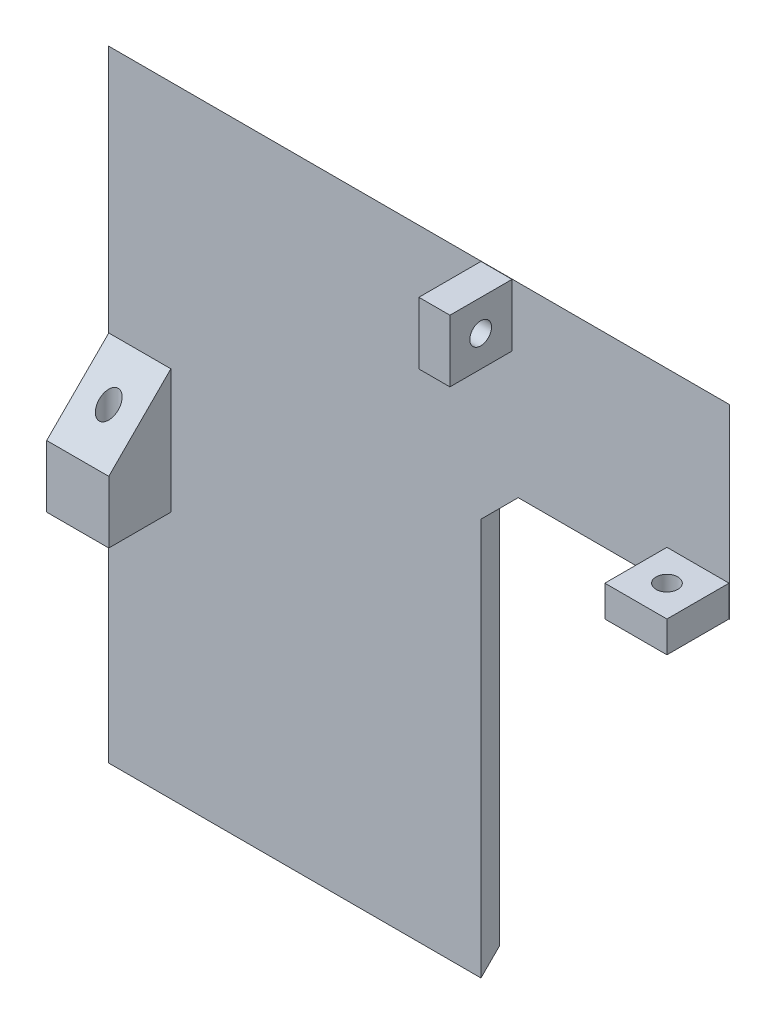
ISO-10303-21;
HEADER;
FILE_DESCRIPTION(('STEP AP214'),'2;1');
FILE_NAME('part.step','',(''),(''),'','','');
FILE_SCHEMA(('AUTOMOTIVE_DESIGN { 1 0 10303 214 1 1 1 1 }'));
ENDSEC;
DATA;
#1=APPLICATION_CONTEXT('core data for automotive mechanical design processes');
#2=APPLICATION_PROTOCOL_DEFINITION('international standard','automotive_design',2000,#1);
#3=PRODUCT_CONTEXT('',#1,'mechanical');
#4=PRODUCT('Part','Part','',(#3));
#5=PRODUCT_RELATED_PRODUCT_CATEGORY('part','',(#4));
#6=PRODUCT_DEFINITION_FORMATION('','',#4);
#7=PRODUCT_DEFINITION_CONTEXT('part definition',#1,'design');
#8=PRODUCT_DEFINITION('design','',#6,#7);
#9=PRODUCT_DEFINITION_SHAPE('','',#8);
#10=(LENGTH_UNIT() NAMED_UNIT(*) SI_UNIT(.MILLI.,.METRE.));
#11=(NAMED_UNIT(*) PLANE_ANGLE_UNIT() SI_UNIT($,.RADIAN.));
#12=(NAMED_UNIT(*) SI_UNIT($,.STERADIAN.) SOLID_ANGLE_UNIT());
#13=UNCERTAINTY_MEASURE_WITH_UNIT(LENGTH_MEASURE(1.E-05),#10,'distance_accuracy_value','');
#14=(GEOMETRIC_REPRESENTATION_CONTEXT(3) GLOBAL_UNCERTAINTY_ASSIGNED_CONTEXT((#13)) GLOBAL_UNIT_ASSIGNED_CONTEXT((#10,
#11,#12)) REPRESENTATION_CONTEXT('',''));
#15=CARTESIAN_POINT('',(0.,0.,0.));
#16=DIRECTION('',(0.,0.,1.));
#17=DIRECTION('',(1.,0.,0.));
#18=AXIS2_PLACEMENT_3D('',#15,#16,#17);
#19=CARTESIAN_POINT('',(0.,0.,3.));
#20=DIRECTION('',(0.,0.,1.));
#21=DIRECTION('',(1.,0.,0.));
#22=AXIS2_PLACEMENT_3D('',#19,#20,#21);
#23=PLANE('',#22);
#24=DIRECTION('',(-1.,0.,0.));
#25=VECTOR('',#24,1.);
#26=CARTESIAN_POINT('',(65.,99.95,3.));
#27=LINE('',#26,#25);
#28=CARTESIAN_POINT('',(65.,99.95,3.));
#29=VERTEX_POINT('',#28);
#30=CARTESIAN_POINT('',(60.,99.95,3.));
#31=VERTEX_POINT('',#30);
#32=EDGE_CURVE('E273',#29,#31,#27,.T.);
#33=ORIENTED_EDGE('',*,*,#32,.F.);
#34=DIRECTION('',(0.,1.,0.));
#35=VECTOR('',#34,1.);
#36=CARTESIAN_POINT('',(65.,99.95,3.));
#37=LINE('',#36,#35);
#38=CARTESIAN_POINT('',(65.,89.95,3.));
#39=VERTEX_POINT('',#38);
#40=EDGE_CURVE('E220',#39,#29,#37,.T.);
#41=ORIENTED_EDGE('',*,*,#40,.F.);
#42=DIRECTION('',(1.,0.,0.));
#43=VECTOR('',#42,1.);
#44=CARTESIAN_POINT('',(65.,89.95,3.));
#45=LINE('',#44,#43);
#46=CARTESIAN_POINT('',(60.,89.95,3.));
#47=VERTEX_POINT('',#46);
#48=EDGE_CURVE('E277',#47,#39,#45,.T.);
#49=ORIENTED_EDGE('',*,*,#48,.F.);
#50=DIRECTION('',(0.,-1.,0.));
#51=VECTOR('',#50,1.);
#52=CARTESIAN_POINT('',(60.,99.95,3.));
#53=LINE('',#52,#51);
#54=EDGE_CURVE('E208',#31,#47,#53,.T.);
#55=ORIENTED_EDGE('',*,*,#54,.F.);
#56=EDGE_LOOP('',(#33,#41,#49,#55));
#57=FACE_BOUND('',#56,.T.);
#58=DIRECTION('',(1.,0.,0.));
#59=VECTOR('',#58,1.);
#60=CARTESIAN_POINT('',(0.0499999999999819,40.,3.));
#61=LINE('',#60,#59);
#62=CARTESIAN_POINT('',(0.0499999999999819,40.,3.));
#63=VERTEX_POINT('',#62);
#64=CARTESIAN_POINT('',(10.05,40.,3.));
#65=VERTEX_POINT('',#64);
#66=EDGE_CURVE('E256',#63,#65,#61,.T.);
#67=ORIENTED_EDGE('',*,*,#66,.F.);
#68=DIRECTION('',(0.,-1.,0.));
#69=VECTOR('',#68,1.);
#70=CARTESIAN_POINT('',(0.0499999999999793,60.,3.));
#71=LINE('',#70,#69);
#72=CARTESIAN_POINT('',(0.0499999999999793,60.,3.));
#73=VERTEX_POINT('',#72);
#74=EDGE_CURVE('E241',#73,#63,#71,.T.);
#75=ORIENTED_EDGE('',*,*,#74,.F.);
#76=DIRECTION('',(-1.,0.,0.));
#77=VECTOR('',#76,1.);
#78=CARTESIAN_POINT('',(0.0499999999999793,60.,3.));
#79=LINE('',#78,#77);
#80=CARTESIAN_POINT('',(10.05,60.,3.));
#81=VERTEX_POINT('',#80);
#82=EDGE_CURVE('E235',#81,#73,#79,.T.);
#83=ORIENTED_EDGE('',*,*,#82,.F.);
#84=DIRECTION('',(0.,1.,0.));
#85=VECTOR('',#84,1.);
#86=CARTESIAN_POINT('',(10.05,60.,3.));
#87=LINE('',#86,#85);
#88=EDGE_CURVE('E239',#65,#81,#87,.T.);
#89=ORIENTED_EDGE('',*,*,#88,.F.);
#90=EDGE_LOOP('',(#67,#75,#83,#89));
#91=FACE_BOUND('',#90,.T.);
#92=DIRECTION('',(0.,-1.,0.));
#93=VECTOR('',#92,1.);
#94=CARTESIAN_POINT('',(60.,-6.39993401119926,3.));
#95=LINE('',#94,#93);
#96=CARTESIAN_POINT('',(60.,64.,3.));
#97=VERTEX_POINT('',#96);
#98=CARTESIAN_POINT('',(60.,0.,3.));
#99=VERTEX_POINT('',#98);
#100=EDGE_CURVE('E204',#97,#99,#95,.T.);
#101=ORIENTED_EDGE('',*,*,#100,.F.);
#102=DIRECTION('',(-0.707106781186541,-0.707106781186554,0.));
#103=VECTOR('',#102,1.);
#104=CARTESIAN_POINT('',(60.,64.,3.));
#105=LINE('',#104,#103);
#106=CARTESIAN_POINT('',(65.9999999999999,70.,3.));
#107=VERTEX_POINT('',#106);
#108=EDGE_CURVE('E43',#97,#107,#105,.F.);
#109=ORIENTED_EDGE('',*,*,#108,.T.);
#110=DIRECTION('',(-1.,0.,0.));
#111=VECTOR('',#110,1.);
#112=CARTESIAN_POINT('',(115.202992823612,70.,3.));
#113=LINE('',#112,#111);
#114=CARTESIAN_POINT('',(100.,70.,3.));
#115=VERTEX_POINT('',#114);
#116=EDGE_CURVE('E200',#115,#107,#113,.T.);
#117=ORIENTED_EDGE('',*,*,#116,.F.);
#118=DIRECTION('',(0.,1.,0.));
#119=VECTOR('',#118,1.);
#120=CARTESIAN_POINT('',(100.,100.,3.));
#121=LINE('',#120,#119);
#122=CARTESIAN_POINT('',(100.,100.,3.));
#123=VERTEX_POINT('',#122);
#124=EDGE_CURVE('E190',#115,#123,#121,.T.);
#125=ORIENTED_EDGE('',*,*,#124,.T.);
#126=DIRECTION('',(-1.,0.,0.));
#127=VECTOR('',#126,1.);
#128=CARTESIAN_POINT('',(0.,100.,3.));
#129=LINE('',#128,#127);
#130=CARTESIAN_POINT('',(0.,100.,3.));
#131=VERTEX_POINT('',#130);
#132=EDGE_CURVE('E192',#123,#131,#129,.T.);
#133=ORIENTED_EDGE('',*,*,#132,.T.);
#134=DIRECTION('',(0.,-1.,0.));
#135=VECTOR('',#134,1.);
#136=CARTESIAN_POINT('',(0.,100.,3.));
#137=LINE('',#136,#135);
#138=CARTESIAN_POINT('',(0.,0.,3.));
#139=VERTEX_POINT('',#138);
#140=EDGE_CURVE('E247',#131,#139,#137,.T.);
#141=ORIENTED_EDGE('',*,*,#140,.T.);
#142=DIRECTION('',(1.,0.,0.));
#143=VECTOR('',#142,1.);
#144=CARTESIAN_POINT('',(0.,0.,3.));
#145=LINE('',#144,#143);
#146=EDGE_CURVE('E249',#139,#99,#145,.T.);
#147=ORIENTED_EDGE('',*,*,#146,.T.);
#148=EDGE_LOOP('',(#101,#109,#117,#125,#133,#141,#147));
#149=FACE_BOUND('',#148,.T.);
#150=DIRECTION('',(1.,0.,0.));
#151=VECTOR('',#150,1.);
#152=CARTESIAN_POINT('',(89.95,70.05,3.));
#153=LINE('',#152,#151);
#154=CARTESIAN_POINT('',(89.95,70.05,3.));
#155=VERTEX_POINT('',#154);
#156=CARTESIAN_POINT('',(99.95,70.05,3.));
#157=VERTEX_POINT('',#156);
#158=EDGE_CURVE('E611',#155,#157,#153,.T.);
#159=ORIENTED_EDGE('',*,*,#158,.F.);
#160=DIRECTION('',(0.,-1.,0.));
#161=VECTOR('',#160,1.);
#162=CARTESIAN_POINT('',(89.95,75.05,3.));
#163=LINE('',#162,#161);
#164=CARTESIAN_POINT('',(89.95,75.05,3.));
#165=VERTEX_POINT('',#164);
#166=EDGE_CURVE('E188',#165,#155,#163,.T.);
#167=ORIENTED_EDGE('',*,*,#166,.F.);
#168=DIRECTION('',(-1.,0.,0.));
#169=VECTOR('',#168,1.);
#170=CARTESIAN_POINT('',(89.95,75.05,3.));
#171=LINE('',#170,#169);
#172=CARTESIAN_POINT('',(99.95,75.05,3.));
#173=VERTEX_POINT('',#172);
#174=EDGE_CURVE('E184',#173,#165,#171,.T.);
#175=ORIENTED_EDGE('',*,*,#174,.F.);
#176=DIRECTION('',(0.,1.,0.));
#177=VECTOR('',#176,1.);
#178=CARTESIAN_POINT('',(99.95,75.05,3.));
#179=LINE('',#178,#177);
#180=EDGE_CURVE('E618',#157,#173,#179,.T.);
#181=ORIENTED_EDGE('',*,*,#180,.F.);
#182=EDGE_LOOP('',(#159,#167,#175,#181));
#183=FACE_BOUND('',#182,.T.);
#184=ADVANCED_FACE('F35',(#57,#91,#149,#183),#23,.T.);
#185=CARTESIAN_POINT('',(0.,0.,0.));
#186=DIRECTION('',(0.,0.,1.));
#187=DIRECTION('',(1.,0.,0.));
#188=AXIS2_PLACEMENT_3D('',#185,#186,#187);
#189=PLANE('',#188);
#190=DIRECTION('',(-1.,0.,0.));
#191=VECTOR('',#190,1.);
#192=CARTESIAN_POINT('',(0.,70.,0.));
#193=LINE('',#192,#191);
#194=CARTESIAN_POINT('',(97.,70.,0.));
#195=VERTEX_POINT('',#194);
#196=CARTESIAN_POINT('',(65.9999999999999,70.,0.));
#197=VERTEX_POINT('',#196);
#198=EDGE_CURVE('E252',#195,#197,#193,.T.);
#199=ORIENTED_EDGE('',*,*,#198,.T.);
#200=DIRECTION('',(0.707106781186541,0.707106781186554,0.));
#201=VECTOR('',#200,1.);
#202=CARTESIAN_POINT('',(-1.99999999999946,1.99999999999943,0.));
#203=LINE('',#202,#201);
#204=CARTESIAN_POINT('',(60.,64.,0.));
#205=VERTEX_POINT('',#204);
#206=EDGE_CURVE('E11',#197,#205,#203,.F.);
#207=ORIENTED_EDGE('',*,*,#206,.T.);
#208=DIRECTION('',(0.,-1.,0.));
#209=VECTOR('',#208,1.);
#210=CARTESIAN_POINT('',(60.,0.,0.));
#211=LINE('',#210,#209);
#212=CARTESIAN_POINT('',(60.,3.00000000000002,0.));
#213=VERTEX_POINT('',#212);
#214=EDGE_CURVE('E224',#205,#213,#211,.T.);
#215=ORIENTED_EDGE('',*,*,#214,.T.);
#216=DIRECTION('',(-1.,0.,0.));
#217=VECTOR('',#216,1.);
#218=CARTESIAN_POINT('',(0.,3.00000000000002,0.));
#219=LINE('',#218,#217);
#220=CARTESIAN_POINT('',(3.00000000000002,3.00000000000002,0.));
#221=VERTEX_POINT('',#220);
#222=EDGE_CURVE('E221',#213,#221,#219,.T.);
#223=ORIENTED_EDGE('',*,*,#222,.T.);
#224=DIRECTION('',(0.,1.,0.));
#225=VECTOR('',#224,1.);
#226=CARTESIAN_POINT('',(3.00000000000002,0.,0.));
#227=LINE('',#226,#225);
#228=CARTESIAN_POINT('',(3.,97.,0.));
#229=VERTEX_POINT('',#228);
#230=EDGE_CURVE('E223',#221,#229,#227,.T.);
#231=ORIENTED_EDGE('',*,*,#230,.T.);
#232=DIRECTION('',(1.,0.,0.));
#233=VECTOR('',#232,1.);
#234=CARTESIAN_POINT('',(0.,97.,0.));
#235=LINE('',#234,#233);
#236=CARTESIAN_POINT('',(97.,97.,0.));
#237=VERTEX_POINT('',#236);
#238=EDGE_CURVE('E229',#229,#237,#235,.T.);
#239=ORIENTED_EDGE('',*,*,#238,.T.);
#240=DIRECTION('',(0.,-1.,0.));
#241=VECTOR('',#240,1.);
#242=CARTESIAN_POINT('',(97.,0.,0.));
#243=LINE('',#242,#241);
#244=EDGE_CURVE('E225',#237,#195,#243,.T.);
#245=ORIENTED_EDGE('',*,*,#244,.T.);
#246=EDGE_LOOP('',(#199,#207,#215,#223,#231,#239,#245));
#247=FACE_BOUND('',#246,.T.);
#248=ADVANCED_FACE('F328',(#247),#189,.F.);
#249=CARTESIAN_POINT('',(0.0499999999999793,60.,13.));
#250=DIRECTION('',(1.,0.,0.));
#251=DIRECTION('',(0.,1.,0.));
#252=AXIS2_PLACEMENT_3D('',#249,#250,#251);
#253=PLANE('',#252);
#254=DIRECTION('',(0.,-1.,0.));
#255=VECTOR('',#254,1.);
#256=CARTESIAN_POINT('',(0.0499999999999793,60.,13.));
#257=LINE('',#256,#255);
#258=CARTESIAN_POINT('',(0.0499999999999806,50.,13.));
#259=VERTEX_POINT('',#258);
#260=CARTESIAN_POINT('',(0.0499999999999819,40.,13.));
#261=VERTEX_POINT('',#260);
#262=EDGE_CURVE('E245',#259,#261,#257,.T.);
#263=ORIENTED_EDGE('',*,*,#262,.F.);
#264=DIRECTION('',(0.,0.707106781186547,-0.707106781186549));
#265=VECTOR('',#264,1.);
#266=CARTESIAN_POINT('',(0.0499999999999806,50.,13.));
#267=LINE('',#266,#265);
#268=EDGE_CURVE('E228',#259,#73,#267,.T.);
#269=ORIENTED_EDGE('',*,*,#268,.T.);
#270=ORIENTED_EDGE('',*,*,#74,.T.);
#271=DIRECTION('',(0.,0.,-1.));
#272=VECTOR('',#271,1.);
#273=CARTESIAN_POINT('',(0.0499999999999819,40.,13.));
#274=LINE('',#273,#272);
#275=EDGE_CURVE('E254',#261,#63,#274,.T.);
#276=ORIENTED_EDGE('',*,*,#275,.F.);
#277=EDGE_LOOP('',(#263,#269,#270,#276));
#278=FACE_BOUND('',#277,.T.);
#279=ADVANCED_FACE('F344',(#278),#253,.F.);
#280=CARTESIAN_POINT('',(0.0499999999999819,40.,13.));
#281=DIRECTION('',(0.,1.,0.));
#282=DIRECTION('',(0.,0.,1.));
#283=AXIS2_PLACEMENT_3D('',#280,#281,#282);
#284=PLANE('',#283);
#285=CARTESIAN_POINT('',(5.04622786455411,40.,8.));
#286=DIRECTION('',(0.,-1.,0.));
#287=DIRECTION('',(0.,0.,-1.));
#288=AXIS2_PLACEMENT_3D('',#285,#286,#287);
#289=CIRCLE('',#288,1.525);
#290=CARTESIAN_POINT('',(5.04622786455411,40.,6.475));
#291=VERTEX_POINT('',#290);
#292=EDGE_CURVE('E214',#291,#291,#289,.T.);
#293=ORIENTED_EDGE('',*,*,#292,.F.);
#294=EDGE_LOOP('',(#293));
#295=FACE_BOUND('',#294,.T.);
#296=ORIENTED_EDGE('',*,*,#66,.T.);
#297=DIRECTION('',(0.,0.,-1.));
#298=VECTOR('',#297,1.);
#299=CARTESIAN_POINT('',(10.05,40.,13.));
#300=LINE('',#299,#298);
#301=CARTESIAN_POINT('',(10.05,40.,13.));
#302=VERTEX_POINT('',#301);
#303=EDGE_CURVE('E238',#302,#65,#300,.T.);
#304=ORIENTED_EDGE('',*,*,#303,.F.);
#305=DIRECTION('',(1.,0.,0.));
#306=VECTOR('',#305,1.);
#307=CARTESIAN_POINT('',(0.0499999999999819,40.,13.));
#308=LINE('',#307,#306);
#309=EDGE_CURVE('E261',#261,#302,#308,.T.);
#310=ORIENTED_EDGE('',*,*,#309,.F.);
#311=ORIENTED_EDGE('',*,*,#275,.T.);
#312=EDGE_LOOP('',(#296,#304,#310,#311));
#313=FACE_BOUND('',#312,.T.);
#314=ADVANCED_FACE('F352',(#295,#313),#284,.F.);
#315=CARTESIAN_POINT('',(10.05,60.,13.));
#316=DIRECTION('',(-1.,0.,0.));
#317=DIRECTION('',(0.,0.,1.));
#318=AXIS2_PLACEMENT_3D('',#315,#316,#317);
#319=PLANE('',#318);
#320=ORIENTED_EDGE('',*,*,#88,.T.);
#321=DIRECTION('',(0.,-0.707106781186547,0.707106781186549));
#322=VECTOR('',#321,1.);
#323=CARTESIAN_POINT('',(10.05,50.,13.));
#324=LINE('',#323,#322);
#325=CARTESIAN_POINT('',(10.05,50.,13.));
#326=VERTEX_POINT('',#325);
#327=EDGE_CURVE('E236',#81,#326,#324,.T.);
#328=ORIENTED_EDGE('',*,*,#327,.T.);
#329=DIRECTION('',(0.,1.,0.));
#330=VECTOR('',#329,1.);
#331=CARTESIAN_POINT('',(10.05,60.,13.));
#332=LINE('',#331,#330);
#333=EDGE_CURVE('E246',#302,#326,#332,.T.);
#334=ORIENTED_EDGE('',*,*,#333,.F.);
#335=ORIENTED_EDGE('',*,*,#303,.T.);
#336=EDGE_LOOP('',(#320,#328,#334,#335));
#337=FACE_BOUND('',#336,.T.);
#338=ADVANCED_FACE('F356',(#337),#319,.F.);
#339=CARTESIAN_POINT('',(0.,0.,13.));
#340=DIRECTION('',(0.,0.,1.));
#341=DIRECTION('',(1.,0.,0.));
#342=AXIS2_PLACEMENT_3D('',#339,#340,#341);
#343=PLANE('',#342);
#344=ORIENTED_EDGE('',*,*,#333,.T.);
#345=DIRECTION('',(-1.,0.,0.));
#346=VECTOR('',#345,1.);
#347=CARTESIAN_POINT('',(0.0499999999999793,50.,13.));
#348=LINE('',#347,#346);
#349=EDGE_CURVE('E242',#326,#259,#348,.T.);
#350=ORIENTED_EDGE('',*,*,#349,.T.);
#351=ORIENTED_EDGE('',*,*,#262,.T.);
#352=ORIENTED_EDGE('',*,*,#309,.T.);
#353=EDGE_LOOP('',(#344,#350,#351,#352));
#354=FACE_BOUND('',#353,.T.);
#355=ADVANCED_FACE('F360',(#354),#343,.T.);
#356=CARTESIAN_POINT('',(0.,50.,13.));
#357=DIRECTION('',(0.,0.707106781186548,0.707106781186546));
#358=DIRECTION('',(1.,0.,0.));
#359=AXIS2_PLACEMENT_3D('',#356,#357,#358);
#360=PLANE('',#359);
#361=CARTESIAN_POINT('',(5.04622786455411,55.,8.));
#362=DIRECTION('',(0.,0.707106781186548,0.707106781186546));
#363=DIRECTION('',(0.,-0.707106781186547,0.707106781186549));
#364=AXIS2_PLACEMENT_3D('',#361,#362,#363);
#365=ELLIPSE('',#364,2.15667568261897,1.525);
#366=CARTESIAN_POINT('',(5.04622786455411,53.475,9.525));
#367=VERTEX_POINT('',#366);
#368=EDGE_CURVE('E232',#367,#367,#365,.T.);
#369=ORIENTED_EDGE('',*,*,#368,.F.);
#370=EDGE_LOOP('',(#369));
#371=FACE_BOUND('',#370,.T.);
#372=ORIENTED_EDGE('',*,*,#327,.F.);
#373=ORIENTED_EDGE('',*,*,#82,.T.);
#374=ORIENTED_EDGE('',*,*,#268,.F.);
#375=ORIENTED_EDGE('',*,*,#349,.F.);
#376=EDGE_LOOP('',(#372,#373,#374,#375));
#377=FACE_BOUND('',#376,.T.);
#378=ADVANCED_FACE('F364',(#371,#377),#360,.T.);
#379=CARTESIAN_POINT('',(5.04622786455411,100.,8.));
#380=DIRECTION('',(0.,-1.,0.));
#381=DIRECTION('',(0.,0.,-1.));
#382=AXIS2_PLACEMENT_3D('',#379,#380,#381);
#383=CYLINDRICAL_SURFACE('',#382,1.525);
#384=ORIENTED_EDGE('',*,*,#368,.T.);
#385=EDGE_LOOP('',(#384));
#386=FACE_BOUND('',#385,.T.);
#387=ORIENTED_EDGE('',*,*,#292,.T.);
#388=EDGE_LOOP('',(#387));
#389=FACE_BOUND('',#388,.T.);
#390=ADVANCED_FACE('F366',(#386,#389),#383,.F.);
#391=CARTESIAN_POINT('',(0.,100.,3.));
#392=DIRECTION('',(0.,-0.707106781186546,0.707106781186549));
#393=DIRECTION('',(-1.,0.,0.));
#394=AXIS2_PLACEMENT_3D('',#391,#392,#393);
#395=PLANE('',#394);
#396=DIRECTION('',(-0.577350269189627,-0.577350269189627,-0.577350269189624));
#397=VECTOR('',#396,1.);
#398=CARTESIAN_POINT('',(66.6666666666666,66.6666666666666,-30.3333333333333));
#399=LINE('',#398,#397);
#400=EDGE_CURVE('E213',#237,#123,#399,.F.);
#401=ORIENTED_EDGE('',*,*,#400,.F.);
#402=ORIENTED_EDGE('',*,*,#238,.F.);
#403=DIRECTION('',(0.577350269189627,-0.577350269189627,-0.577350269189624));
#404=VECTOR('',#403,1.);
#405=CARTESIAN_POINT('',(0.,100.,3.));
#406=LINE('',#405,#404);
#407=EDGE_CURVE('E210',#131,#229,#406,.T.);
#408=ORIENTED_EDGE('',*,*,#407,.F.);
#409=ORIENTED_EDGE('',*,*,#132,.F.);
#410=EDGE_LOOP('',(#401,#402,#408,#409));
#411=FACE_BOUND('',#410,.T.);
#412=ADVANCED_FACE('F369',(#411),#395,.F.);
#413=CARTESIAN_POINT('',(0.,100.,3.));
#414=DIRECTION('',(0.707106781186546,0.,0.707106781186549));
#415=DIRECTION('',(0.,-1.,0.));
#416=AXIS2_PLACEMENT_3D('',#413,#414,#415);
#417=PLANE('',#416);
#418=ORIENTED_EDGE('',*,*,#407,.T.);
#419=ORIENTED_EDGE('',*,*,#230,.F.);
#420=DIRECTION('',(-0.577350269189627,-0.577350269189627,0.577350269189624));
#421=VECTOR('',#420,1.);
#422=CARTESIAN_POINT('',(33.3333333333334,33.3333333333334,-30.3333333333333));
#423=LINE('',#422,#421);
#424=EDGE_CURVE('E217',#139,#221,#423,.F.);
#425=ORIENTED_EDGE('',*,*,#424,.F.);
#426=ORIENTED_EDGE('',*,*,#140,.F.);
#427=EDGE_LOOP('',(#418,#419,#425,#426));
#428=FACE_BOUND('',#427,.T.);
#429=ADVANCED_FACE('F508',(#428),#417,.F.);
#430=CARTESIAN_POINT('',(100.,100.,3.));
#431=DIRECTION('',(-0.707106781186546,0.,0.707106781186549));
#432=DIRECTION('',(0.,1.,0.));
#433=AXIS2_PLACEMENT_3D('',#430,#431,#432);
#434=PLANE('',#433);
#435=DIRECTION('',(-0.707106781186549,0.,-0.707106781186546));
#436=VECTOR('',#435,1.);
#437=CARTESIAN_POINT('',(100.,70.,3.));
#438=LINE('',#437,#436);
#439=EDGE_CURVE('E198',#195,#115,#438,.F.);
#440=ORIENTED_EDGE('',*,*,#439,.F.);
#441=ORIENTED_EDGE('',*,*,#244,.F.);
#442=ORIENTED_EDGE('',*,*,#400,.T.);
#443=ORIENTED_EDGE('',*,*,#124,.F.);
#444=EDGE_LOOP('',(#440,#441,#442,#443));
#445=FACE_BOUND('',#444,.T.);
#446=ADVANCED_FACE('F500',(#445),#434,.F.);
#447=CARTESIAN_POINT('',(0.,0.,3.));
#448=DIRECTION('',(0.,0.707106781186546,0.707106781186549));
#449=DIRECTION('',(1.,0.,0.));
#450=AXIS2_PLACEMENT_3D('',#447,#448,#449);
#451=PLANE('',#450);
#452=DIRECTION('',(0.,-0.707106781186549,0.707106781186546));
#453=VECTOR('',#452,1.);
#454=CARTESIAN_POINT('',(60.,0.,3.));
#455=LINE('',#454,#453);
#456=EDGE_CURVE('E201',#99,#213,#455,.F.);
#457=ORIENTED_EDGE('',*,*,#456,.F.);
#458=ORIENTED_EDGE('',*,*,#146,.F.);
#459=ORIENTED_EDGE('',*,*,#424,.T.);
#460=ORIENTED_EDGE('',*,*,#222,.F.);
#461=EDGE_LOOP('',(#457,#458,#459,#460));
#462=FACE_BOUND('',#461,.T.);
#463=ADVANCED_FACE('F324',(#462),#451,.F.);
#464=CARTESIAN_POINT('',(65.,99.95,13.));
#465=DIRECTION('',(-1.,0.,0.));
#466=DIRECTION('',(0.,0.,1.));
#467=AXIS2_PLACEMENT_3D('',#464,#465,#466);
#468=PLANE('',#467);
#469=CARTESIAN_POINT('',(65.,94.95,8.05));
#470=DIRECTION('',(1.,0.,0.));
#471=DIRECTION('',(0.,0.,-1.));
#472=AXIS2_PLACEMENT_3D('',#469,#470,#471);
#473=CIRCLE('',#472,1.75);
#474=CARTESIAN_POINT('',(65.,94.95,6.3));
#475=VERTEX_POINT('',#474);
#476=EDGE_CURVE('E292',#475,#475,#473,.T.);
#477=ORIENTED_EDGE('',*,*,#476,.F.);
#478=EDGE_LOOP('',(#477));
#479=FACE_BOUND('',#478,.T.);
#480=ORIENTED_EDGE('',*,*,#40,.T.);
#481=DIRECTION('',(0.,0.,-1.));
#482=VECTOR('',#481,1.);
#483=CARTESIAN_POINT('',(65.,99.95,13.));
#484=LINE('',#483,#482);
#485=CARTESIAN_POINT('',(65.,99.95,13.));
#486=VERTEX_POINT('',#485);
#487=EDGE_CURVE('E209',#486,#29,#484,.T.);
#488=ORIENTED_EDGE('',*,*,#487,.F.);
#489=DIRECTION('',(0.,1.,0.));
#490=VECTOR('',#489,1.);
#491=CARTESIAN_POINT('',(65.,99.95,13.));
#492=LINE('',#491,#490);
#493=CARTESIAN_POINT('',(65.,89.95,13.));
#494=VERTEX_POINT('',#493);
#495=EDGE_CURVE('E280',#494,#486,#492,.T.);
#496=ORIENTED_EDGE('',*,*,#495,.F.);
#497=DIRECTION('',(0.,0.,-1.));
#498=VECTOR('',#497,1.);
#499=CARTESIAN_POINT('',(65.,89.95,13.));
#500=LINE('',#499,#498);
#501=EDGE_CURVE('E281',#494,#39,#500,.T.);
#502=ORIENTED_EDGE('',*,*,#501,.T.);
#503=EDGE_LOOP('',(#480,#488,#496,#502));
#504=FACE_BOUND('',#503,.T.);
#505=ADVANCED_FACE('F371',(#479,#504),#468,.F.);
#506=CARTESIAN_POINT('',(65.,99.95,13.));
#507=DIRECTION('',(0.,-1.,0.));
#508=DIRECTION('',(0.,0.,-1.));
#509=AXIS2_PLACEMENT_3D('',#506,#507,#508);
#510=PLANE('',#509);
#511=ORIENTED_EDGE('',*,*,#32,.T.);
#512=DIRECTION('',(0.,0.,-1.));
#513=VECTOR('',#512,1.);
#514=CARTESIAN_POINT('',(60.,99.95,13.));
#515=LINE('',#514,#513);
#516=CARTESIAN_POINT('',(60.,99.95,13.));
#517=VERTEX_POINT('',#516);
#518=EDGE_CURVE('E274',#517,#31,#515,.T.);
#519=ORIENTED_EDGE('',*,*,#518,.F.);
#520=DIRECTION('',(-1.,0.,0.));
#521=VECTOR('',#520,1.);
#522=CARTESIAN_POINT('',(65.,99.95,13.));
#523=LINE('',#522,#521);
#524=EDGE_CURVE('E295',#486,#517,#523,.T.);
#525=ORIENTED_EDGE('',*,*,#524,.F.);
#526=ORIENTED_EDGE('',*,*,#487,.T.);
#527=EDGE_LOOP('',(#511,#519,#525,#526));
#528=FACE_BOUND('',#527,.T.);
#529=ADVANCED_FACE('F374',(#528),#510,.F.);
#530=CARTESIAN_POINT('',(60.,99.95,13.));
#531=DIRECTION('',(1.,0.,0.));
#532=DIRECTION('',(0.,1.,0.));
#533=AXIS2_PLACEMENT_3D('',#530,#531,#532);
#534=PLANE('',#533);
#535=CARTESIAN_POINT('',(60.,94.95,8.05));
#536=DIRECTION('',(1.,0.,0.));
#537=DIRECTION('',(0.,1.,0.));
#538=AXIS2_PLACEMENT_3D('',#535,#536,#537);
#539=CIRCLE('',#538,1.75);
#540=CARTESIAN_POINT('',(60.,96.7,8.05));
#541=VERTEX_POINT('',#540);
#542=EDGE_CURVE('E205',#541,#541,#539,.T.);
#543=ORIENTED_EDGE('',*,*,#542,.T.);
#544=EDGE_LOOP('',(#543));
#545=FACE_BOUND('',#544,.T.);
#546=ORIENTED_EDGE('',*,*,#54,.T.);
#547=DIRECTION('',(0.,0.,-1.));
#548=VECTOR('',#547,1.);
#549=CARTESIAN_POINT('',(60.,89.95,13.));
#550=LINE('',#549,#548);
#551=CARTESIAN_POINT('',(60.,89.95,13.));
#552=VERTEX_POINT('',#551);
#553=EDGE_CURVE('E278',#552,#47,#550,.T.);
#554=ORIENTED_EDGE('',*,*,#553,.F.);
#555=DIRECTION('',(0.,-1.,0.));
#556=VECTOR('',#555,1.);
#557=CARTESIAN_POINT('',(60.,99.95,13.));
#558=LINE('',#557,#556);
#559=EDGE_CURVE('E293',#517,#552,#558,.T.);
#560=ORIENTED_EDGE('',*,*,#559,.F.);
#561=ORIENTED_EDGE('',*,*,#518,.T.);
#562=EDGE_LOOP('',(#546,#554,#560,#561));
#563=FACE_BOUND('',#562,.T.);
#564=ADVANCED_FACE('F378',(#545,#563),#534,.F.);
#565=CARTESIAN_POINT('',(65.,89.95,13.));
#566=DIRECTION('',(0.,1.,0.));
#567=DIRECTION('',(-1.,0.,0.));
#568=AXIS2_PLACEMENT_3D('',#565,#566,#567);
#569=PLANE('',#568);
#570=ORIENTED_EDGE('',*,*,#48,.T.);
#571=ORIENTED_EDGE('',*,*,#501,.F.);
#572=DIRECTION('',(1.,0.,0.));
#573=VECTOR('',#572,1.);
#574=CARTESIAN_POINT('',(65.,89.95,13.));
#575=LINE('',#574,#573);
#576=EDGE_CURVE('E290',#552,#494,#575,.T.);
#577=ORIENTED_EDGE('',*,*,#576,.F.);
#578=ORIENTED_EDGE('',*,*,#553,.T.);
#579=EDGE_LOOP('',(#570,#571,#577,#578));
#580=FACE_BOUND('',#579,.T.);
#581=ADVANCED_FACE('F382',(#580),#569,.F.);
#582=CARTESIAN_POINT('',(0.,0.,13.));
#583=DIRECTION('',(0.,0.,-1.));
#584=DIRECTION('',(-1.,0.,0.));
#585=AXIS2_PLACEMENT_3D('',#582,#583,#584);
#586=PLANE('',#585);
#587=ORIENTED_EDGE('',*,*,#495,.T.);
#588=ORIENTED_EDGE('',*,*,#524,.T.);
#589=ORIENTED_EDGE('',*,*,#559,.T.);
#590=ORIENTED_EDGE('',*,*,#576,.T.);
#591=EDGE_LOOP('',(#587,#588,#589,#590));
#592=FACE_BOUND('',#591,.T.);
#593=ADVANCED_FACE('F386',(#592),#586,.F.);
#594=CARTESIAN_POINT('',(55.,94.95,8.05));
#595=DIRECTION('',(1.,0.,0.));
#596=DIRECTION('',(0.,0.,-1.));
#597=AXIS2_PLACEMENT_3D('',#594,#595,#596);
#598=CYLINDRICAL_SURFACE('',#597,1.75);
#599=ORIENTED_EDGE('',*,*,#476,.T.);
#600=EDGE_LOOP('',(#599));
#601=FACE_BOUND('',#600,.T.);
#602=ORIENTED_EDGE('',*,*,#542,.F.);
#603=EDGE_LOOP('',(#602));
#604=FACE_BOUND('',#603,.T.);
#605=ADVANCED_FACE('F390',(#601,#604),#598,.F.);
#606=CARTESIAN_POINT('',(60.,-6.39993401119926,-7.));
#607=DIRECTION('',(-1.,0.,0.));
#608=DIRECTION('',(0.,0.,1.));
#609=AXIS2_PLACEMENT_3D('',#606,#607,#608);
#610=PLANE('',#609);
#611=ORIENTED_EDGE('',*,*,#214,.F.);
#612=DIRECTION('',(0.,0.,1.));
#613=VECTOR('',#612,1.);
#614=CARTESIAN_POINT('',(60.,64.,3.));
#615=LINE('',#614,#613);
#616=EDGE_CURVE('E305',#205,#97,#615,.T.);
#617=ORIENTED_EDGE('',*,*,#616,.T.);
#618=ORIENTED_EDGE('',*,*,#100,.T.);
#619=ORIENTED_EDGE('',*,*,#456,.T.);
#620=EDGE_LOOP('',(#611,#617,#618,#619));
#621=FACE_BOUND('',#620,.T.);
#622=ADVANCED_FACE('F315',(#621),#610,.F.);
#623=CARTESIAN_POINT('',(115.202992823612,70.,-7.));
#624=DIRECTION('',(0.,1.,0.));
#625=DIRECTION('',(0.,0.,1.));
#626=AXIS2_PLACEMENT_3D('',#623,#624,#625);
#627=PLANE('',#626);
#628=ORIENTED_EDGE('',*,*,#116,.T.);
#629=DIRECTION('',(0.,0.,-1.));
#630=VECTOR('',#629,1.);
#631=CARTESIAN_POINT('',(65.9999999999999,70.,0.));
#632=LINE('',#631,#630);
#633=EDGE_CURVE('E50',#107,#197,#632,.T.);
#634=ORIENTED_EDGE('',*,*,#633,.T.);
#635=ORIENTED_EDGE('',*,*,#198,.F.);
#636=ORIENTED_EDGE('',*,*,#439,.T.);
#637=EDGE_LOOP('',(#628,#634,#635,#636));
#638=FACE_BOUND('',#637,.T.);
#639=ADVANCED_FACE('F395',(#638),#627,.F.);
#640=CARTESIAN_POINT('',(89.95,75.05,13.));
#641=DIRECTION('',(1.,0.,0.));
#642=DIRECTION('',(0.,0.,-1.));
#643=AXIS2_PLACEMENT_3D('',#640,#641,#642);
#644=PLANE('',#643);
#645=ORIENTED_EDGE('',*,*,#166,.T.);
#646=DIRECTION('',(0.,0.,-1.));
#647=VECTOR('',#646,1.);
#648=CARTESIAN_POINT('',(89.95,70.05,13.));
#649=LINE('',#648,#647);
#650=CARTESIAN_POINT('',(89.95,70.05,13.));
#651=VERTEX_POINT('',#650);
#652=EDGE_CURVE('E168',#651,#155,#649,.T.);
#653=ORIENTED_EDGE('',*,*,#652,.F.);
#654=DIRECTION('',(0.,-1.,0.));
#655=VECTOR('',#654,1.);
#656=CARTESIAN_POINT('',(89.95,75.05,13.));
#657=LINE('',#656,#655);
#658=CARTESIAN_POINT('',(89.95,75.05,13.));
#659=VERTEX_POINT('',#658);
#660=EDGE_CURVE('E175',#659,#651,#657,.T.);
#661=ORIENTED_EDGE('',*,*,#660,.F.);
#662=DIRECTION('',(0.,0.,-1.));
#663=VECTOR('',#662,1.);
#664=CARTESIAN_POINT('',(89.95,75.05,13.));
#665=LINE('',#664,#663);
#666=EDGE_CURVE('E615',#659,#165,#665,.T.);
#667=ORIENTED_EDGE('',*,*,#666,.T.);
#668=EDGE_LOOP('',(#645,#653,#661,#667));
#669=FACE_BOUND('',#668,.T.);
#670=ADVANCED_FACE('F186',(#669),#644,.F.);
#671=CARTESIAN_POINT('',(89.95,70.05,13.));
#672=DIRECTION('',(0.,1.,0.));
#673=DIRECTION('',(0.,0.,1.));
#674=AXIS2_PLACEMENT_3D('',#671,#672,#673);
#675=PLANE('',#674);
#676=CARTESIAN_POINT('',(94.95,70.05,8.));
#677=DIRECTION('',(0.,1.,0.));
#678=DIRECTION('',(0.,0.,1.));
#679=AXIS2_PLACEMENT_3D('',#676,#677,#678);
#680=CIRCLE('',#679,1.75);
#681=CARTESIAN_POINT('',(94.95,70.05,9.75));
#682=VERTEX_POINT('',#681);
#683=EDGE_CURVE('E309',#682,#682,#680,.T.);
#684=ORIENTED_EDGE('',*,*,#683,.T.);
#685=EDGE_LOOP('',(#684));
#686=FACE_BOUND('',#685,.T.);
#687=ORIENTED_EDGE('',*,*,#158,.T.);
#688=DIRECTION('',(0.,0.,-1.));
#689=VECTOR('',#688,1.);
#690=CARTESIAN_POINT('',(99.95,70.05,13.));
#691=LINE('',#690,#689);
#692=CARTESIAN_POINT('',(99.95,70.05,13.));
#693=VERTEX_POINT('',#692);
#694=EDGE_CURVE('E171',#693,#157,#691,.T.);
#695=ORIENTED_EDGE('',*,*,#694,.F.);
#696=DIRECTION('',(1.,0.,0.));
#697=VECTOR('',#696,1.);
#698=CARTESIAN_POINT('',(89.95,70.05,13.));
#699=LINE('',#698,#697);
#700=EDGE_CURVE('E164',#651,#693,#699,.T.);
#701=ORIENTED_EDGE('',*,*,#700,.F.);
#702=ORIENTED_EDGE('',*,*,#652,.T.);
#703=EDGE_LOOP('',(#687,#695,#701,#702));
#704=FACE_BOUND('',#703,.T.);
#705=ADVANCED_FACE('F166',(#686,#704),#675,.F.);
#706=CARTESIAN_POINT('',(99.95,75.05,13.));
#707=DIRECTION('',(-1.,0.,0.));
#708=DIRECTION('',(0.,0.,1.));
#709=AXIS2_PLACEMENT_3D('',#706,#707,#708);
#710=PLANE('',#709);
#711=ORIENTED_EDGE('',*,*,#180,.T.);
#712=DIRECTION('',(0.,0.,-1.));
#713=VECTOR('',#712,1.);
#714=CARTESIAN_POINT('',(99.95,75.05,13.));
#715=LINE('',#714,#713);
#716=CARTESIAN_POINT('',(99.95,75.05,13.));
#717=VERTEX_POINT('',#716);
#718=EDGE_CURVE('E194',#717,#173,#715,.T.);
#719=ORIENTED_EDGE('',*,*,#718,.F.);
#720=DIRECTION('',(0.,1.,0.));
#721=VECTOR('',#720,1.);
#722=CARTESIAN_POINT('',(99.95,75.05,13.));
#723=LINE('',#722,#721);
#724=EDGE_CURVE('E174',#693,#717,#723,.T.);
#725=ORIENTED_EDGE('',*,*,#724,.F.);
#726=ORIENTED_EDGE('',*,*,#694,.T.);
#727=EDGE_LOOP('',(#711,#719,#725,#726));
#728=FACE_BOUND('',#727,.T.);
#729=ADVANCED_FACE('F433',(#728),#710,.F.);
#730=CARTESIAN_POINT('',(89.95,75.05,13.));
#731=DIRECTION('',(0.,-1.,0.));
#732=DIRECTION('',(0.,0.,-1.));
#733=AXIS2_PLACEMENT_3D('',#730,#731,#732);
#734=PLANE('',#733);
#735=CARTESIAN_POINT('',(94.95,75.05,8.));
#736=DIRECTION('',(0.,-1.,0.));
#737=DIRECTION('',(0.,0.,-1.));
#738=AXIS2_PLACEMENT_3D('',#735,#736,#737);
#739=CIRCLE('',#738,1.75);
#740=CARTESIAN_POINT('',(94.95,75.05,6.25));
#741=VERTEX_POINT('',#740);
#742=EDGE_CURVE('E306',#741,#741,#739,.T.);
#743=ORIENTED_EDGE('',*,*,#742,.T.);
#744=EDGE_LOOP('',(#743));
#745=FACE_BOUND('',#744,.T.);
#746=ORIENTED_EDGE('',*,*,#174,.T.);
#747=ORIENTED_EDGE('',*,*,#666,.F.);
#748=DIRECTION('',(-1.,0.,0.));
#749=VECTOR('',#748,1.);
#750=CARTESIAN_POINT('',(89.95,75.05,13.));
#751=LINE('',#750,#749);
#752=EDGE_CURVE('E180',#717,#659,#751,.T.);
#753=ORIENTED_EDGE('',*,*,#752,.F.);
#754=ORIENTED_EDGE('',*,*,#718,.T.);
#755=EDGE_LOOP('',(#746,#747,#753,#754));
#756=FACE_BOUND('',#755,.T.);
#757=ADVANCED_FACE('F424',(#745,#756),#734,.F.);
#758=CARTESIAN_POINT('',(0.,0.,13.));
#759=DIRECTION('',(0.,0.,1.));
#760=DIRECTION('',(1.,0.,0.));
#761=AXIS2_PLACEMENT_3D('',#758,#759,#760);
#762=PLANE('',#761);
#763=ORIENTED_EDGE('',*,*,#660,.T.);
#764=ORIENTED_EDGE('',*,*,#700,.T.);
#765=ORIENTED_EDGE('',*,*,#724,.T.);
#766=ORIENTED_EDGE('',*,*,#752,.T.);
#767=EDGE_LOOP('',(#763,#764,#765,#766));
#768=FACE_BOUND('',#767,.T.);
#769=ADVANCED_FACE('F178',(#768),#762,.T.);
#770=CARTESIAN_POINT('',(94.95,80.,8.));
#771=DIRECTION('',(0.,-1.,0.));
#772=DIRECTION('',(0.,0.,-1.));
#773=AXIS2_PLACEMENT_3D('',#770,#771,#772);
#774=CYLINDRICAL_SURFACE('',#773,1.75);
#775=ORIENTED_EDGE('',*,*,#742,.F.);
#776=EDGE_LOOP('',(#775));
#777=FACE_BOUND('',#776,.T.);
#778=ORIENTED_EDGE('',*,*,#683,.F.);
#779=EDGE_LOOP('',(#778));
#780=FACE_BOUND('',#779,.T.);
#781=ADVANCED_FACE('F331',(#777,#780),#774,.F.);
#782=CARTESIAN_POINT('',(60.,64.,-7.));
#783=DIRECTION('',(0.707106781186554,-0.707106781186541,0.));
#784=DIRECTION('',(0.,0.,-1.));
#785=AXIS2_PLACEMENT_3D('',#782,#783,#784);
#786=PLANE('',#785);
#787=ORIENTED_EDGE('',*,*,#206,.F.);
#788=ORIENTED_EDGE('',*,*,#633,.F.);
#789=ORIENTED_EDGE('',*,*,#108,.F.);
#790=ORIENTED_EDGE('',*,*,#616,.F.);
#791=EDGE_LOOP('',(#787,#788,#789,#790));
#792=FACE_BOUND('',#791,.T.);
#793=ADVANCED_FACE('F37',(#792),#786,.T.);
#794=CLOSED_SHELL('',(#184,#248,#279,#314,#338,#355,#378,#390,#412,#429,#446,#463,#505,#529,
#564,#581,#593,#605,#622,#639,#670,#705,#729,#757,#769,#781,#793));
#795=MANIFOLD_SOLID_BREP('B2',#794);
#796=ADVANCED_BREP_SHAPE_REPRESENTATION('',(#18,#795),#14);
#797=SHAPE_DEFINITION_REPRESENTATION(#9,#796);
ENDSEC;
END-ISO-10303-21;
